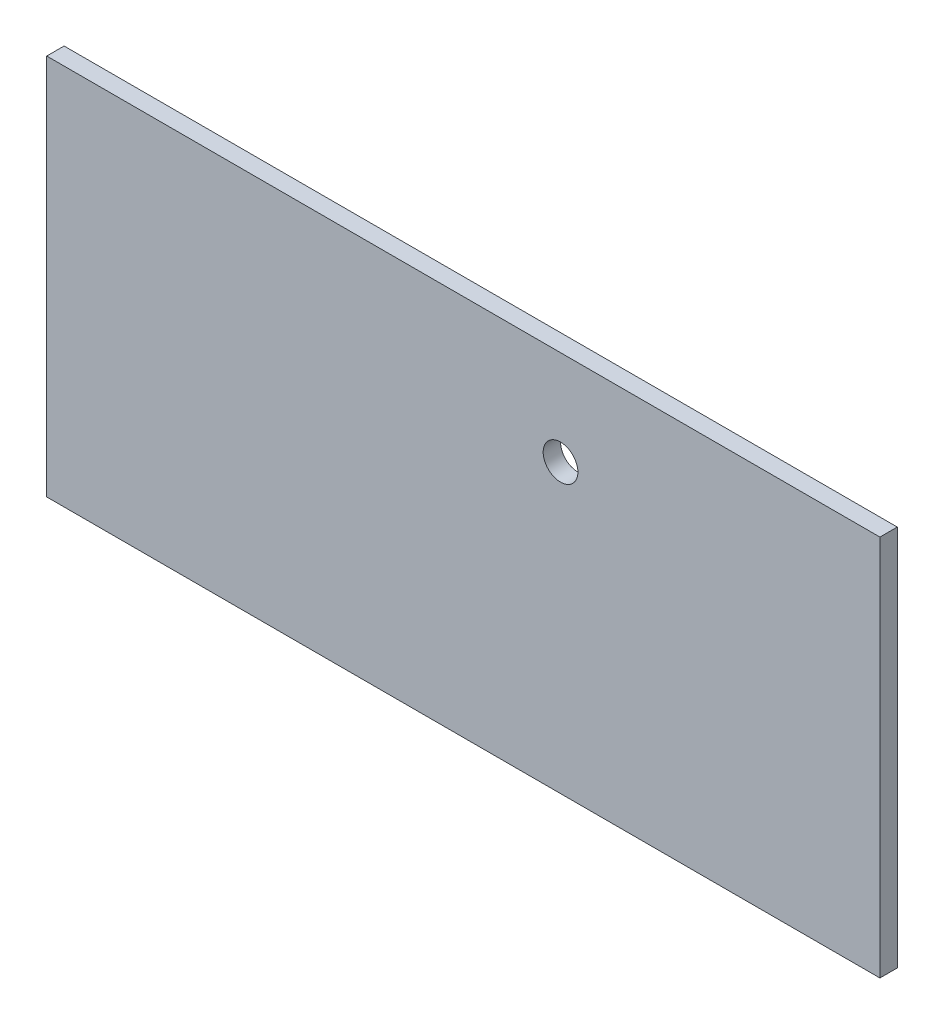
ISO-10303-21;
HEADER;
FILE_DESCRIPTION(('STEP AP214'),'2;1');
FILE_NAME('part.step','',(''),(''),'','','');
FILE_SCHEMA(('AUTOMOTIVE_DESIGN { 1 0 10303 214 1 1 1 1 }'));
ENDSEC;
DATA;
#1=APPLICATION_CONTEXT('core data for automotive mechanical design processes');
#2=APPLICATION_PROTOCOL_DEFINITION('international standard','automotive_design',2000,#1);
#3=PRODUCT_CONTEXT('',#1,'mechanical');
#4=PRODUCT('Part','Part','',(#3));
#5=PRODUCT_RELATED_PRODUCT_CATEGORY('part','',(#4));
#6=PRODUCT_DEFINITION_FORMATION('','',#4);
#7=PRODUCT_DEFINITION_CONTEXT('part definition',#1,'design');
#8=PRODUCT_DEFINITION('design','',#6,#7);
#9=PRODUCT_DEFINITION_SHAPE('','',#8);
#10=(LENGTH_UNIT() NAMED_UNIT(*) SI_UNIT(.MILLI.,.METRE.));
#11=(NAMED_UNIT(*) PLANE_ANGLE_UNIT() SI_UNIT($,.RADIAN.));
#12=(NAMED_UNIT(*) SI_UNIT($,.STERADIAN.) SOLID_ANGLE_UNIT());
#13=UNCERTAINTY_MEASURE_WITH_UNIT(LENGTH_MEASURE(1.E-05),#10,'distance_accuracy_value','');
#14=(GEOMETRIC_REPRESENTATION_CONTEXT(3) GLOBAL_UNCERTAINTY_ASSIGNED_CONTEXT((#13)) GLOBAL_UNIT_ASSIGNED_CONTEXT((#10,
#11,#12)) REPRESENTATION_CONTEXT('',''));
#15=CARTESIAN_POINT('',(0.,0.,0.));
#16=DIRECTION('',(0.,0.,1.));
#17=DIRECTION('',(1.,0.,0.));
#18=AXIS2_PLACEMENT_3D('',#15,#16,#17);
#19=CARTESIAN_POINT('',(0.,0.,5.));
#20=DIRECTION('',(-1.,0.,0.));
#21=DIRECTION('',(0.,0.,1.));
#22=AXIS2_PLACEMENT_3D('',#19,#20,#21);
#23=PLANE('',#22);
#24=DIRECTION('',(0.,1.,0.));
#25=VECTOR('',#24,1.);
#26=CARTESIAN_POINT('',(0.,0.,0.));
#27=LINE('',#26,#25);
#28=CARTESIAN_POINT('',(0.,0.,0.));
#29=VERTEX_POINT('',#28);
#30=CARTESIAN_POINT('',(0.,110.,0.));
#31=VERTEX_POINT('',#30);
#32=EDGE_CURVE('E100',#29,#31,#27,.T.);
#33=ORIENTED_EDGE('',*,*,#32,.T.);
#34=DIRECTION('',(0.,0.,-1.));
#35=VECTOR('',#34,1.);
#36=CARTESIAN_POINT('',(0.,110.,0.));
#37=LINE('',#36,#35);
#38=CARTESIAN_POINT('',(0.,110.,5.));
#39=VERTEX_POINT('',#38);
#40=EDGE_CURVE('E88',#39,#31,#37,.T.);
#41=ORIENTED_EDGE('',*,*,#40,.F.);
#42=DIRECTION('',(0.,1.,0.));
#43=VECTOR('',#42,1.);
#44=CARTESIAN_POINT('',(0.,0.,5.));
#45=LINE('',#44,#43);
#46=CARTESIAN_POINT('',(0.,0.,5.));
#47=VERTEX_POINT('',#46);
#48=EDGE_CURVE('E79',#47,#39,#45,.T.);
#49=ORIENTED_EDGE('',*,*,#48,.F.);
#50=DIRECTION('',(0.,0.,-1.));
#51=VECTOR('',#50,1.);
#52=CARTESIAN_POINT('',(0.,0.,5.));
#53=LINE('',#52,#51);
#54=EDGE_CURVE('E41',#47,#29,#53,.T.);
#55=ORIENTED_EDGE('',*,*,#54,.T.);
#56=EDGE_LOOP('',(#33,#41,#49,#55));
#57=FACE_BOUND('',#56,.T.);
#58=ADVANCED_FACE('F33',(#57),#23,.F.);
#59=CARTESIAN_POINT('',(-240.,0.,5.));
#60=DIRECTION('',(1.,0.,0.));
#61=DIRECTION('',(0.,0.,-1.));
#62=AXIS2_PLACEMENT_3D('',#59,#60,#61);
#63=PLANE('',#62);
#64=DIRECTION('',(0.,-1.,0.));
#65=VECTOR('',#64,1.);
#66=CARTESIAN_POINT('',(-240.,0.,0.));
#67=LINE('',#66,#65);
#68=CARTESIAN_POINT('',(-240.,110.,0.));
#69=VERTEX_POINT('',#68);
#70=CARTESIAN_POINT('',(-240.,0.,0.));
#71=VERTEX_POINT('',#70);
#72=EDGE_CURVE('E60',#69,#71,#67,.T.);
#73=ORIENTED_EDGE('',*,*,#72,.T.);
#74=DIRECTION('',(0.,0.,-1.));
#75=VECTOR('',#74,1.);
#76=CARTESIAN_POINT('',(-240.,0.,5.));
#77=LINE('',#76,#75);
#78=CARTESIAN_POINT('',(-240.,0.,5.));
#79=VERTEX_POINT('',#78);
#80=EDGE_CURVE('E11',#79,#71,#77,.T.);
#81=ORIENTED_EDGE('',*,*,#80,.F.);
#82=DIRECTION('',(0.,-1.,0.));
#83=VECTOR('',#82,1.);
#84=CARTESIAN_POINT('',(-240.,0.,5.));
#85=LINE('',#84,#83);
#86=CARTESIAN_POINT('',(-240.,110.,5.));
#87=VERTEX_POINT('',#86);
#88=EDGE_CURVE('E74',#87,#79,#85,.T.);
#89=ORIENTED_EDGE('',*,*,#88,.F.);
#90=DIRECTION('',(0.,0.,1.));
#91=VECTOR('',#90,1.);
#92=CARTESIAN_POINT('',(-240.,110.,0.));
#93=LINE('',#92,#91);
#94=EDGE_CURVE('E78',#69,#87,#93,.T.);
#95=ORIENTED_EDGE('',*,*,#94,.F.);
#96=EDGE_LOOP('',(#73,#81,#89,#95));
#97=FACE_BOUND('',#96,.T.);
#98=ADVANCED_FACE('F76',(#97),#63,.F.);
#99=CARTESIAN_POINT('',(0.,0.,5.));
#100=DIRECTION('',(0.,1.,0.));
#101=DIRECTION('',(-1.,0.,0.));
#102=AXIS2_PLACEMENT_3D('',#99,#100,#101);
#103=PLANE('',#102);
#104=DIRECTION('',(1.,0.,0.));
#105=VECTOR('',#104,1.);
#106=CARTESIAN_POINT('',(0.,0.,0.));
#107=LINE('',#106,#105);
#108=EDGE_CURVE('E103',#71,#29,#107,.T.);
#109=ORIENTED_EDGE('',*,*,#108,.T.);
#110=ORIENTED_EDGE('',*,*,#54,.F.);
#111=DIRECTION('',(1.,0.,0.));
#112=VECTOR('',#111,1.);
#113=CARTESIAN_POINT('',(0.,0.,5.));
#114=LINE('',#113,#112);
#115=EDGE_CURVE('E49',#79,#47,#114,.T.);
#116=ORIENTED_EDGE('',*,*,#115,.F.);
#117=ORIENTED_EDGE('',*,*,#80,.T.);
#118=EDGE_LOOP('',(#109,#110,#116,#117));
#119=FACE_BOUND('',#118,.T.);
#120=ADVANCED_FACE('F113',(#119),#103,.F.);
#121=CARTESIAN_POINT('',(0.,0.,5.));
#122=DIRECTION('',(0.,0.,1.));
#123=DIRECTION('',(1.,0.,0.));
#124=AXIS2_PLACEMENT_3D('',#121,#122,#123);
#125=PLANE('',#124);
#126=CARTESIAN_POINT('',(-92.,82.7,5.));
#127=DIRECTION('',(0.,0.,1.));
#128=DIRECTION('',(1.,0.,0.));
#129=AXIS2_PLACEMENT_3D('',#126,#127,#128);
#130=CIRCLE('',#129,5.00000000000001);
#131=CARTESIAN_POINT('',(-87.,82.7,5.));
#132=VERTEX_POINT('',#131);
#133=EDGE_CURVE('E96',#132,#132,#130,.T.);
#134=ORIENTED_EDGE('',*,*,#133,.F.);
#135=EDGE_LOOP('',(#134));
#136=FACE_BOUND('',#135,.T.);
#137=ORIENTED_EDGE('',*,*,#48,.T.);
#138=DIRECTION('',(1.,0.,0.));
#139=VECTOR('',#138,1.);
#140=CARTESIAN_POINT('',(-240.,110.,5.));
#141=LINE('',#140,#139);
#142=EDGE_CURVE('E82',#87,#39,#141,.T.);
#143=ORIENTED_EDGE('',*,*,#142,.F.);
#144=ORIENTED_EDGE('',*,*,#88,.T.);
#145=ORIENTED_EDGE('',*,*,#115,.T.);
#146=EDGE_LOOP('',(#137,#143,#144,#145));
#147=FACE_BOUND('',#146,.T.);
#148=ADVANCED_FACE('F83',(#136,#147),#125,.T.);
#149=CARTESIAN_POINT('',(0.,0.,0.));
#150=DIRECTION('',(0.,0.,1.));
#151=DIRECTION('',(1.,0.,0.));
#152=AXIS2_PLACEMENT_3D('',#149,#150,#151);
#153=PLANE('',#152);
#154=CARTESIAN_POINT('',(-92.,82.7,0.));
#155=DIRECTION('',(0.,0.,1.));
#156=DIRECTION('',(1.,0.,0.));
#157=AXIS2_PLACEMENT_3D('',#154,#155,#156);
#158=CIRCLE('',#157,5.00000000000001);
#159=CARTESIAN_POINT('',(-87.,82.7,0.));
#160=VERTEX_POINT('',#159);
#161=EDGE_CURVE('E97',#160,#160,#158,.T.);
#162=ORIENTED_EDGE('',*,*,#161,.T.);
#163=EDGE_LOOP('',(#162));
#164=FACE_BOUND('',#163,.T.);
#165=ORIENTED_EDGE('',*,*,#32,.F.);
#166=ORIENTED_EDGE('',*,*,#108,.F.);
#167=ORIENTED_EDGE('',*,*,#72,.F.);
#168=DIRECTION('',(-1.,0.,0.));
#169=VECTOR('',#168,1.);
#170=CARTESIAN_POINT('',(-240.,110.,0.));
#171=LINE('',#170,#169);
#172=EDGE_CURVE('E91',#31,#69,#171,.T.);
#173=ORIENTED_EDGE('',*,*,#172,.F.);
#174=EDGE_LOOP('',(#165,#166,#167,#173));
#175=FACE_BOUND('',#174,.T.);
#176=ADVANCED_FACE('F112',(#164,#175),#153,.F.);
#177=CARTESIAN_POINT('',(-92.,82.7,0.));
#178=DIRECTION('',(0.,0.,1.));
#179=DIRECTION('',(1.,0.,0.));
#180=AXIS2_PLACEMENT_3D('',#177,#178,#179);
#181=CYLINDRICAL_SURFACE('',#180,5.00000000000001);
#182=ORIENTED_EDGE('',*,*,#161,.F.);
#183=EDGE_LOOP('',(#182));
#184=FACE_BOUND('',#183,.T.);
#185=ORIENTED_EDGE('',*,*,#133,.T.);
#186=EDGE_LOOP('',(#185));
#187=FACE_BOUND('',#186,.T.);
#188=ADVANCED_FACE('F131',(#184,#187),#181,.F.);
#189=CARTESIAN_POINT('',(0.,110.,0.));
#190=DIRECTION('',(0.,1.,0.));
#191=DIRECTION('',(-1.,0.,0.));
#192=AXIS2_PLACEMENT_3D('',#189,#190,#191);
#193=PLANE('',#192);
#194=ORIENTED_EDGE('',*,*,#94,.T.);
#195=ORIENTED_EDGE('',*,*,#142,.T.);
#196=ORIENTED_EDGE('',*,*,#40,.T.);
#197=ORIENTED_EDGE('',*,*,#172,.T.);
#198=EDGE_LOOP('',(#194,#195,#196,#197));
#199=FACE_BOUND('',#198,.T.);
#200=ADVANCED_FACE('F90',(#199),#193,.T.);
#201=CLOSED_SHELL('',(#58,#98,#120,#148,#176,#188,#200));
#202=MANIFOLD_SOLID_BREP('B2',#201);
#203=ADVANCED_BREP_SHAPE_REPRESENTATION('',(#18,#202),#14);
#204=SHAPE_DEFINITION_REPRESENTATION(#9,#203);
ENDSEC;
END-ISO-10303-21;
